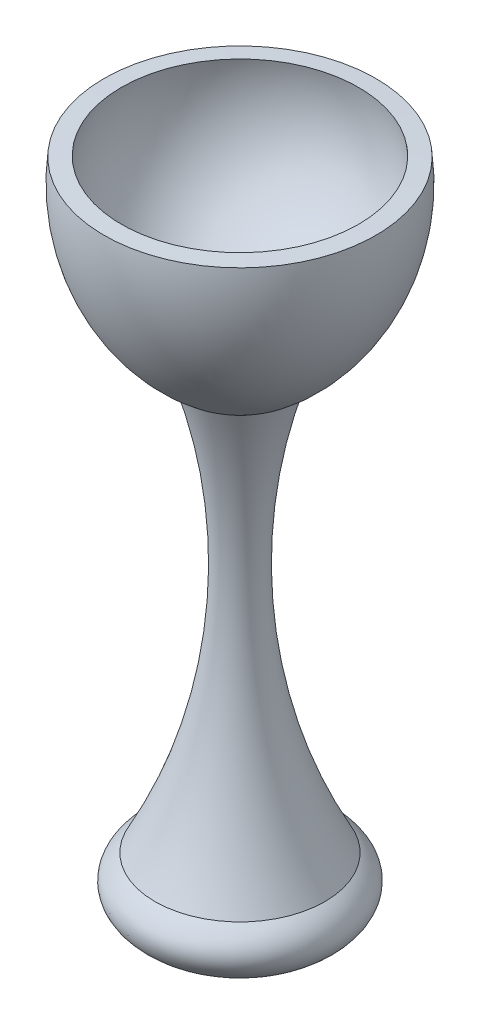
ISO-10303-21;
HEADER;
FILE_DESCRIPTION(('STEP AP214'),'2;1');
FILE_NAME('part.step','',(''),(''),'','','');
FILE_SCHEMA(('AUTOMOTIVE_DESIGN { 1 0 10303 214 1 1 1 1 }'));
ENDSEC;
DATA;
#1=APPLICATION_CONTEXT('core data for automotive mechanical design processes');
#2=APPLICATION_PROTOCOL_DEFINITION('international standard','automotive_design',2000,#1);
#3=PRODUCT_CONTEXT('',#1,'mechanical');
#4=PRODUCT('Part','Part','',(#3));
#5=PRODUCT_RELATED_PRODUCT_CATEGORY('part','',(#4));
#6=PRODUCT_DEFINITION_FORMATION('','',#4);
#7=PRODUCT_DEFINITION_CONTEXT('part definition',#1,'design');
#8=PRODUCT_DEFINITION('design','',#6,#7);
#9=PRODUCT_DEFINITION_SHAPE('','',#8);
#10=(LENGTH_UNIT() NAMED_UNIT(*) SI_UNIT(.MILLI.,.METRE.));
#11=(NAMED_UNIT(*) PLANE_ANGLE_UNIT() SI_UNIT($,.RADIAN.));
#12=(NAMED_UNIT(*) SI_UNIT($,.STERADIAN.) SOLID_ANGLE_UNIT());
#13=UNCERTAINTY_MEASURE_WITH_UNIT(LENGTH_MEASURE(1.E-05),#10,'distance_accuracy_value','');
#14=(GEOMETRIC_REPRESENTATION_CONTEXT(3) GLOBAL_UNCERTAINTY_ASSIGNED_CONTEXT((#13)) GLOBAL_UNIT_ASSIGNED_CONTEXT((#10,
#11,#12)) REPRESENTATION_CONTEXT('',''));
#15=CARTESIAN_POINT('',(0.,0.,0.));
#16=DIRECTION('',(0.,0.,1.));
#17=DIRECTION('',(1.,0.,0.));
#18=AXIS2_PLACEMENT_3D('',#15,#16,#17);
#19=CARTESIAN_POINT('',(0.,-254.,0.));
#20=DIRECTION('',(0.,0.,1.));
#21=DIRECTION('',(-1.,0.,0.));
#22=AXIS2_PLACEMENT_3D('',#19,#20,#21);
#23=ELLIPSE('',#22,42.2910000000001,19.05);
#24=TRIMMED_CURVE('',#23,(PARAMETER_VALUE(1.57079632679489)),
(PARAMETER_VALUE(4.71238898038469)),.T.,.PARAMETER.);
#25=CARTESIAN_POINT('',(0.,-50.8,0.));
#26=DIRECTION('',(0.,1.,0.));
#27=AXIS1_PLACEMENT('',#25,#26);
#28=SURFACE_OF_REVOLUTION('',#24,#27);
#29=CARTESIAN_POINT('',(0.,-243.792158977545,0.));
#30=DIRECTION('',(0.,1.,0.));
#31=DIRECTION('',(-1.,0.,0.));
#32=AXIS2_PLACEMENT_3D('',#29,#30,#31);
#33=CIRCLE('',#32,35.7069924610655);
#34=CARTESIAN_POINT('',(-35.7069924610655,-243.792158977545,0.));
#35=VERTEX_POINT('',#34);
#36=EDGE_CURVE('E11',#35,#35,#33,.T.);
#37=ORIENTED_EDGE('',*,*,#36,.F.);
#38=EDGE_LOOP('',(#37));
#39=FACE_BOUND('',#38,.T.);
#40=CARTESIAN_POINT('',(0.,-273.05,0.));
#41=VERTEX_POINT('',#40);
#42=VERTEX_LOOP('',#41);
#43=FACE_BOUND('',#42,.T.);
#44=ADVANCED_FACE('F43',(#39,#43),#28,.T.);
#45=CARTESIAN_POINT('',(0.,-138.463994454621,0.));
#46=DIRECTION('',(0.,1.,0.));
#47=DIRECTION('',(-1.,0.,0.));
#48=AXIS2_PLACEMENT_3D('',#45,#46,#47);
#49=TOROIDAL_SURFACE('',#48,232.854572101881,223.52);
#50=CARTESIAN_POINT('',(0.,-70.665126560054,0.));
#51=DIRECTION('',(0.,1.,0.));
#52=DIRECTION('',(-1.,0.,0.));
#53=AXIS2_PLACEMENT_3D('',#50,#51,#52);
#54=CIRCLE('',#53,19.8651265600539);
#55=CARTESIAN_POINT('',(-19.8651265600539,-70.665126560054,0.));
#56=VERTEX_POINT('',#55);
#57=EDGE_CURVE('E51',#56,#56,#54,.T.);
#58=ORIENTED_EDGE('',*,*,#57,.F.);
#59=EDGE_LOOP('',(#58));
#60=FACE_BOUND('',#59,.T.);
#61=ORIENTED_EDGE('',*,*,#36,.T.);
#62=EDGE_LOOP('',(#61));
#63=FACE_BOUND('',#62,.T.);
#64=ADVANCED_FACE('F55',(#60,#63),#49,.F.);
#65=CARTESIAN_POINT('',(0.,-0.164225450160052,0.));
#66=DIRECTION('',(0.,1.,0.));
#67=DIRECTION('',(-1.,0.,0.));
#68=AXIS2_PLACEMENT_3D('',#65,#66,#67);
#69=DEGENERATE_TOROIDAL_SURFACE('',#68,27.0031331679641,84.6582000000002,.F.);
#70=CARTESIAN_POINT('',(0.,9.38585961968409,0.));
#71=DIRECTION('',(0.,1.,0.));
#72=DIRECTION('',(-1.,0.,0.));
#73=AXIS2_PLACEMENT_3D('',#70,#71,#72);
#74=CIRCLE('',#73,57.1146812496655);
#75=CARTESIAN_POINT('',(-57.1146812496655,9.38585961968409,0.));
#76=VERTEX_POINT('',#75);
#77=EDGE_CURVE('E84',#76,#76,#74,.T.);
#78=ORIENTED_EDGE('',*,*,#77,.F.);
#79=EDGE_LOOP('',(#78));
#80=FACE_BOUND('',#79,.T.);
#81=ORIENTED_EDGE('',*,*,#57,.T.);
#82=EDGE_LOOP('',(#81));
#83=FACE_BOUND('',#82,.T.);
#84=ADVANCED_FACE('F60',(#80,#83),#69,.F.);
#85=CARTESIAN_POINT('',(0.,9.38585961968409,0.));
#86=DIRECTION('',(0.,-1.,0.));
#87=DIRECTION('',(1.,0.,0.));
#88=AXIS2_PLACEMENT_3D('',#85,#86,#87);
#89=CONICAL_SURFACE('',#88,57.1146812496655,1.51789712118549);
#90=CARTESIAN_POINT('',(0.,9.77043141283714,0.));
#91=DIRECTION('',(0.,1.,0.));
#92=DIRECTION('',(-1.,0.,0.));
#93=AXIS2_PLACEMENT_3D('',#90,#91,#92);
#94=CIRCLE('',#93,49.8515663746591);
#95=CARTESIAN_POINT('',(-49.8515663746591,9.77043141283714,0.));
#96=VERTEX_POINT('',#95);
#97=EDGE_CURVE('E82',#96,#96,#94,.T.);
#98=ORIENTED_EDGE('',*,*,#97,.F.);
#99=EDGE_LOOP('',(#98));
#100=FACE_BOUND('',#99,.T.);
#101=ORIENTED_EDGE('',*,*,#77,.T.);
#102=EDGE_LOOP('',(#101));
#103=FACE_BOUND('',#102,.T.);
#104=ADVANCED_FACE('F67',(#100,#103),#89,.T.);
#105=CARTESIAN_POINT('',(0.,0.,0.));
#106=DIRECTION('',(0.,1.,0.));
#107=DIRECTION('',(1.,0.,0.));
#108=AXIS2_PLACEMENT_3D('',#105,#106,#107);
#109=SPHERICAL_SURFACE('',#108,50.8);
#110=ORIENTED_EDGE('',*,*,#97,.T.);
#111=EDGE_LOOP('',(#110));
#112=FACE_BOUND('',#111,.T.);
#113=ADVANCED_FACE('F74',(#112),#109,.F.);
#114=CLOSED_SHELL('',(#44,#64,#84,#104,#113));
#115=MANIFOLD_SOLID_BREP('B2',#114);
#116=ADVANCED_BREP_SHAPE_REPRESENTATION('',(#18,#115),#14);
#117=SHAPE_DEFINITION_REPRESENTATION(#9,#116);
ENDSEC;
END-ISO-10303-21;
